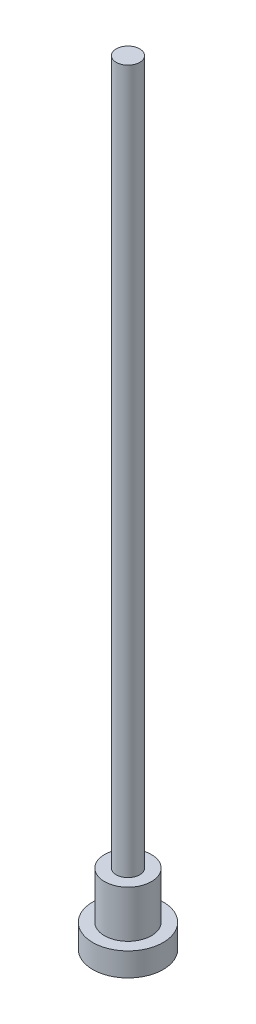
ISO-10303-21;
HEADER;
FILE_DESCRIPTION(('STEP AP214'),'2;1');
FILE_NAME('part.step','',(''),(''),'','','');
FILE_SCHEMA(('AUTOMOTIVE_DESIGN { 1 0 10303 214 1 1 1 1 }'));
ENDSEC;
DATA;
#1=APPLICATION_CONTEXT('core data for automotive mechanical design processes');
#2=APPLICATION_PROTOCOL_DEFINITION('international standard','automotive_design',2000,#1);
#3=PRODUCT_CONTEXT('',#1,'mechanical');
#4=PRODUCT('Part','Part','',(#3));
#5=PRODUCT_RELATED_PRODUCT_CATEGORY('part','',(#4));
#6=PRODUCT_DEFINITION_FORMATION('','',#4);
#7=PRODUCT_DEFINITION_CONTEXT('part definition',#1,'design');
#8=PRODUCT_DEFINITION('design','',#6,#7);
#9=PRODUCT_DEFINITION_SHAPE('','',#8);
#10=(LENGTH_UNIT() NAMED_UNIT(*) SI_UNIT(.MILLI.,.METRE.));
#11=(NAMED_UNIT(*) PLANE_ANGLE_UNIT() SI_UNIT($,.RADIAN.));
#12=(NAMED_UNIT(*) SI_UNIT($,.STERADIAN.) SOLID_ANGLE_UNIT());
#13=UNCERTAINTY_MEASURE_WITH_UNIT(LENGTH_MEASURE(1.E-05),#10,'distance_accuracy_value','');
#14=(GEOMETRIC_REPRESENTATION_CONTEXT(3) GLOBAL_UNCERTAINTY_ASSIGNED_CONTEXT((#13)) GLOBAL_UNIT_ASSIGNED_CONTEXT((#10,
#11,#12)) REPRESENTATION_CONTEXT('',''));
#15=CARTESIAN_POINT('',(0.,0.,0.));
#16=DIRECTION('',(0.,0.,1.));
#17=DIRECTION('',(1.,0.,0.));
#18=AXIS2_PLACEMENT_3D('',#15,#16,#17);
#19=CARTESIAN_POINT('',(0.,1.,0.));
#20=DIRECTION('',(0.,-1.,0.));
#21=DIRECTION('',(0.,0.,-1.));
#22=AXIS2_PLACEMENT_3D('',#19,#20,#21);
#23=CYLINDRICAL_SURFACE('',#22,1.5);
#24=CARTESIAN_POINT('',(0.,1.,0.));
#25=DIRECTION('',(0.,1.,0.));
#26=DIRECTION('',(0.,0.,1.));
#27=AXIS2_PLACEMENT_3D('',#24,#25,#26);
#28=CIRCLE('',#27,1.5);
#29=CARTESIAN_POINT('',(0.,1.,1.5));
#30=VERTEX_POINT('',#29);
#31=EDGE_CURVE('E55',#30,#30,#28,.T.);
#32=ORIENTED_EDGE('',*,*,#31,.F.);
#33=EDGE_LOOP('',(#32));
#34=FACE_BOUND('',#33,.T.);
#35=CARTESIAN_POINT('',(0.,0.,0.));
#36=DIRECTION('',(0.,1.,0.));
#37=DIRECTION('',(0.,0.,1.));
#38=AXIS2_PLACEMENT_3D('',#35,#36,#37);
#39=CIRCLE('',#38,1.5);
#40=CARTESIAN_POINT('',(0.,0.,1.5));
#41=VERTEX_POINT('',#40);
#42=EDGE_CURVE('E44',#41,#41,#39,.T.);
#43=ORIENTED_EDGE('',*,*,#42,.T.);
#44=EDGE_LOOP('',(#43));
#45=FACE_BOUND('',#44,.T.);
#46=ADVANCED_FACE('F41',(#34,#45),#23,.T.);
#47=CARTESIAN_POINT('',(0.,1.,0.));
#48=DIRECTION('',(0.,1.,0.));
#49=DIRECTION('',(0.,0.,1.));
#50=AXIS2_PLACEMENT_3D('',#47,#48,#49);
#51=PLANE('',#50);
#52=CARTESIAN_POINT('',(0.,1.,0.));
#53=DIRECTION('',(0.,1.,0.));
#54=DIRECTION('',(0.,0.,1.));
#55=AXIS2_PLACEMENT_3D('',#52,#53,#54);
#56=CIRCLE('',#55,1.);
#57=CARTESIAN_POINT('',(0.,1.,1.));
#58=VERTEX_POINT('',#57);
#59=EDGE_CURVE('E49',#58,#58,#56,.T.);
#60=ORIENTED_EDGE('',*,*,#59,.F.);
#61=EDGE_LOOP('',(#60));
#62=FACE_BOUND('',#61,.T.);
#63=ORIENTED_EDGE('',*,*,#31,.T.);
#64=EDGE_LOOP('',(#63));
#65=FACE_BOUND('',#64,.T.);
#66=ADVANCED_FACE('F75',(#62,#65),#51,.T.);
#67=CARTESIAN_POINT('',(0.,0.,0.));
#68=DIRECTION('',(0.,1.,0.));
#69=DIRECTION('',(0.,0.,1.));
#70=AXIS2_PLACEMENT_3D('',#67,#68,#69);
#71=PLANE('',#70);
#72=ORIENTED_EDGE('',*,*,#42,.F.);
#73=EDGE_LOOP('',(#72));
#74=FACE_BOUND('',#73,.T.);
#75=ADVANCED_FACE('F72',(#74),#71,.F.);
#76=CARTESIAN_POINT('',(0.,3.,0.));
#77=DIRECTION('',(0.,-1.,0.));
#78=DIRECTION('',(0.,0.,-1.));
#79=AXIS2_PLACEMENT_3D('',#76,#77,#78);
#80=CYLINDRICAL_SURFACE('',#79,1.);
#81=CARTESIAN_POINT('',(0.,3.,0.));
#82=DIRECTION('',(0.,1.,0.));
#83=DIRECTION('',(0.,0.,1.));
#84=AXIS2_PLACEMENT_3D('',#81,#82,#83);
#85=CIRCLE('',#84,1.);
#86=CARTESIAN_POINT('',(0.,3.,1.));
#87=VERTEX_POINT('',#86);
#88=EDGE_CURVE('E60',#87,#87,#85,.T.);
#89=ORIENTED_EDGE('',*,*,#88,.F.);
#90=EDGE_LOOP('',(#89));
#91=FACE_BOUND('',#90,.T.);
#92=ORIENTED_EDGE('',*,*,#59,.T.);
#93=EDGE_LOOP('',(#92));
#94=FACE_BOUND('',#93,.T.);
#95=ADVANCED_FACE('F74',(#91,#94),#80,.T.);
#96=CARTESIAN_POINT('',(0.,3.,0.));
#97=DIRECTION('',(0.,1.,0.));
#98=DIRECTION('',(0.,0.,1.));
#99=AXIS2_PLACEMENT_3D('',#96,#97,#98);
#100=PLANE('',#99);
#101=CARTESIAN_POINT('',(0.,3.,0.));
#102=DIRECTION('',(0.,1.,0.));
#103=DIRECTION('',(0.,0.,1.));
#104=AXIS2_PLACEMENT_3D('',#101,#102,#103);
#105=CIRCLE('',#104,0.5);
#106=CARTESIAN_POINT('',(0.,3.,0.5));
#107=VERTEX_POINT('',#106);
#108=EDGE_CURVE('E10',#107,#107,#105,.T.);
#109=ORIENTED_EDGE('',*,*,#108,.F.);
#110=EDGE_LOOP('',(#109));
#111=FACE_BOUND('',#110,.T.);
#112=ORIENTED_EDGE('',*,*,#88,.T.);
#113=EDGE_LOOP('',(#112));
#114=FACE_BOUND('',#113,.T.);
#115=ADVANCED_FACE('F80',(#111,#114),#100,.T.);
#116=CARTESIAN_POINT('',(0.,33.,0.));
#117=DIRECTION('',(0.,-1.,0.));
#118=DIRECTION('',(0.,0.,-1.));
#119=AXIS2_PLACEMENT_3D('',#116,#117,#118);
#120=CYLINDRICAL_SURFACE('',#119,0.5);
#121=CARTESIAN_POINT('',(0.,33.,0.));
#122=DIRECTION('',(0.,1.,0.));
#123=DIRECTION('',(0.,0.,1.));
#124=AXIS2_PLACEMENT_3D('',#121,#122,#123);
#125=CIRCLE('',#124,0.5);
#126=CARTESIAN_POINT('',(0.,33.,0.5));
#127=VERTEX_POINT('',#126);
#128=EDGE_CURVE('E59',#127,#127,#125,.T.);
#129=ORIENTED_EDGE('',*,*,#128,.F.);
#130=EDGE_LOOP('',(#129));
#131=FACE_BOUND('',#130,.T.);
#132=ORIENTED_EDGE('',*,*,#108,.T.);
#133=EDGE_LOOP('',(#132));
#134=FACE_BOUND('',#133,.T.);
#135=ADVANCED_FACE('F112',(#131,#134),#120,.T.);
#136=CARTESIAN_POINT('',(0.,33.,0.));
#137=DIRECTION('',(0.,1.,0.));
#138=DIRECTION('',(0.,0.,1.));
#139=AXIS2_PLACEMENT_3D('',#136,#137,#138);
#140=PLANE('',#139);
#141=ORIENTED_EDGE('',*,*,#128,.T.);
#142=EDGE_LOOP('',(#141));
#143=FACE_BOUND('',#142,.T.);
#144=ADVANCED_FACE('F123',(#143),#140,.T.);
#145=CLOSED_SHELL('',(#46,#66,#75,#95,#115,#135,#144));
#146=MANIFOLD_SOLID_BREP('B2',#145);
#147=ADVANCED_BREP_SHAPE_REPRESENTATION('',(#18,#146),#14);
#148=SHAPE_DEFINITION_REPRESENTATION(#9,#147);
ENDSEC;
END-ISO-10303-21;
